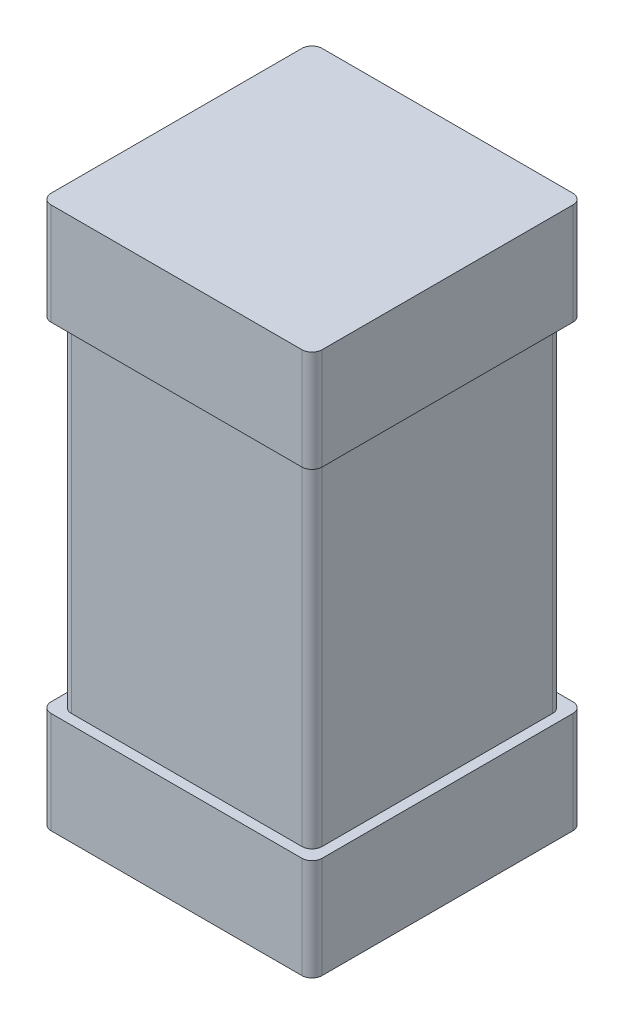
ISO-10303-21;
HEADER;
FILE_DESCRIPTION(('STEP AP214'),'2;1');
FILE_NAME('part.step','',(''),(''),'','','');
FILE_SCHEMA(('AUTOMOTIVE_DESIGN { 1 0 10303 214 1 1 1 1 }'));
ENDSEC;
DATA;
#1=APPLICATION_CONTEXT('core data for automotive mechanical design processes');
#2=APPLICATION_PROTOCOL_DEFINITION('international standard','automotive_design',2000,#1);
#3=PRODUCT_CONTEXT('',#1,'mechanical');
#4=PRODUCT('Part','Part','',(#3));
#5=PRODUCT_RELATED_PRODUCT_CATEGORY('part','',(#4));
#6=PRODUCT_DEFINITION_FORMATION('','',#4);
#7=PRODUCT_DEFINITION_CONTEXT('part definition',#1,'design');
#8=PRODUCT_DEFINITION('design','',#6,#7);
#9=PRODUCT_DEFINITION_SHAPE('','',#8);
#10=(LENGTH_UNIT() NAMED_UNIT(*) SI_UNIT(.MILLI.,.METRE.));
#11=(NAMED_UNIT(*) PLANE_ANGLE_UNIT() SI_UNIT($,.RADIAN.));
#12=(NAMED_UNIT(*) SI_UNIT($,.STERADIAN.) SOLID_ANGLE_UNIT());
#13=UNCERTAINTY_MEASURE_WITH_UNIT(LENGTH_MEASURE(1.E-05),#10,'distance_accuracy_value','');
#14=(GEOMETRIC_REPRESENTATION_CONTEXT(3) GLOBAL_UNCERTAINTY_ASSIGNED_CONTEXT((#13)) GLOBAL_UNIT_ASSIGNED_CONTEXT((#10,
#11,#12)) REPRESENTATION_CONTEXT('',''));
#15=CARTESIAN_POINT('',(0.,0.,0.));
#16=DIRECTION('',(0.,0.,1.));
#17=DIRECTION('',(1.,0.,0.));
#18=AXIS2_PLACEMENT_3D('',#15,#16,#17);
#19=CARTESIAN_POINT('',(182.392744279938,99.9820432923502,112.211582908599));
#20=DIRECTION('',(0.,-1.,0.));
#21=DIRECTION('',(0.,0.,-1.));
#22=AXIS2_PLACEMENT_3D('',#19,#20,#21);
#23=PLANE('',#22);
#24=DIRECTION('',(0.,0.,1.));
#25=VECTOR('',#24,1.);
#26=CARTESIAN_POINT('',(182.392744279938,99.9820432923502,112.211582908599));
#27=LINE('',#26,#25);
#28=CARTESIAN_POINT('',(182.392744279938,99.9820432923502,112.241582908599));
#29=VERTEX_POINT('',#28);
#30=CARTESIAN_POINT('',(182.392744279938,99.9820432923502,112.981582908599));
#31=VERTEX_POINT('',#30);
#32=EDGE_CURVE('E48',#29,#31,#27,.T.);
#33=ORIENTED_EDGE('',*,*,#32,.F.);
#34=CARTESIAN_POINT('',(182.422744279938,99.9820432923502,112.241582908599));
#35=DIRECTION('',(0.,-1.,0.));
#36=DIRECTION('',(0.,0.,1.));
#37=AXIS2_PLACEMENT_3D('',#34,#35,#36);
#38=CIRCLE('',#37,0.0300000000000023);
#39=CARTESIAN_POINT('',(182.422744279938,99.9820432923502,112.211582908599));
#40=VERTEX_POINT('',#39);
#41=EDGE_CURVE('E11',#29,#40,#38,.T.);
#42=ORIENTED_EDGE('',*,*,#41,.T.);
#43=DIRECTION('',(1.,0.,0.));
#44=VECTOR('',#43,1.);
#45=CARTESIAN_POINT('',(182.392744279938,99.9820432923502,112.211582908599));
#46=LINE('',#45,#44);
#47=CARTESIAN_POINT('',(183.162744279938,99.9820432923502,112.211582908599));
#48=VERTEX_POINT('',#47);
#49=EDGE_CURVE('E55',#40,#48,#46,.T.);
#50=ORIENTED_EDGE('',*,*,#49,.T.);
#51=CARTESIAN_POINT('',(183.162744279938,99.9820432923502,112.241582908599));
#52=DIRECTION('',(0.,1.,0.));
#53=DIRECTION('',(0.,0.,1.));
#54=AXIS2_PLACEMENT_3D('',#51,#52,#53);
#55=CIRCLE('',#54,0.0300000000000023);
#56=CARTESIAN_POINT('',(183.192744279938,99.9820432923502,112.241582908599));
#57=VERTEX_POINT('',#56);
#58=EDGE_CURVE('E289',#57,#48,#55,.T.);
#59=ORIENTED_EDGE('',*,*,#58,.F.);
#60=DIRECTION('',(0.,0.,1.));
#61=VECTOR('',#60,1.);
#62=CARTESIAN_POINT('',(183.192744279938,99.9820432923502,112.211582908599));
#63=LINE('',#62,#61);
#64=CARTESIAN_POINT('',(183.192744279938,99.9820432923502,112.981582908599));
#65=VERTEX_POINT('',#64);
#66=EDGE_CURVE('E201',#57,#65,#63,.T.);
#67=ORIENTED_EDGE('',*,*,#66,.T.);
#68=CARTESIAN_POINT('',(183.162744279938,99.9820432923502,112.981582908599));
#69=DIRECTION('',(0.,-1.,0.));
#70=DIRECTION('',(0.,0.,1.));
#71=AXIS2_PLACEMENT_3D('',#68,#69,#70);
#72=CIRCLE('',#71,0.0300000000000023);
#73=CARTESIAN_POINT('',(183.162744279938,99.9820432923502,113.011582908599));
#74=VERTEX_POINT('',#73);
#75=EDGE_CURVE('E394',#65,#74,#72,.T.);
#76=ORIENTED_EDGE('',*,*,#75,.T.);
#77=DIRECTION('',(1.,0.,0.));
#78=VECTOR('',#77,1.);
#79=CARTESIAN_POINT('',(182.392744279938,99.9820432923502,113.011582908599));
#80=LINE('',#79,#78);
#81=CARTESIAN_POINT('',(182.422744279938,99.9820432923502,113.011582908599));
#82=VERTEX_POINT('',#81);
#83=EDGE_CURVE('E355',#82,#74,#80,.T.);
#84=ORIENTED_EDGE('',*,*,#83,.F.);
#85=CARTESIAN_POINT('',(182.422744279938,99.9820432923502,112.981582908599));
#86=DIRECTION('',(0.,1.,0.));
#87=DIRECTION('',(0.,0.,1.));
#88=AXIS2_PLACEMENT_3D('',#85,#86,#87);
#89=CIRCLE('',#88,0.0300000000000023);
#90=EDGE_CURVE('E203',#31,#82,#89,.T.);
#91=ORIENTED_EDGE('',*,*,#90,.F.);
#92=EDGE_LOOP('',(#33,#42,#50,#59,#67,#76,#84,#91));
#93=FACE_BOUND('',#92,.T.);
#94=ADVANCED_FACE('F44',(#93),#23,.T.);
#95=CARTESIAN_POINT('',(183.192744279938,100.28204329235,112.211582908599));
#96=DIRECTION('',(1.,0.,0.));
#97=DIRECTION('',(0.,0.,1.));
#98=AXIS2_PLACEMENT_3D('',#95,#96,#97);
#99=PLANE('',#98);
#100=ORIENTED_EDGE('',*,*,#66,.F.);
#101=DIRECTION('',(0.,-1.,0.));
#102=VECTOR('',#101,1.);
#103=CARTESIAN_POINT('',(183.192744279938,100.28204329235,112.241582908599));
#104=LINE('',#103,#102);
#105=CARTESIAN_POINT('',(183.192744279938,100.28204329235,112.241582908599));
#106=VERTEX_POINT('',#105);
#107=EDGE_CURVE('E285',#106,#57,#104,.T.);
#108=ORIENTED_EDGE('',*,*,#107,.F.);
#109=DIRECTION('',(0.,0.,1.));
#110=VECTOR('',#109,1.);
#111=CARTESIAN_POINT('',(183.192744279938,100.28204329235,112.211582908599));
#112=LINE('',#111,#110);
#113=CARTESIAN_POINT('',(183.192744279938,100.28204329235,112.981582908599));
#114=VERTEX_POINT('',#113);
#115=EDGE_CURVE('E398',#106,#114,#112,.T.);
#116=ORIENTED_EDGE('',*,*,#115,.T.);
#117=DIRECTION('',(0.,-1.,0.));
#118=VECTOR('',#117,1.);
#119=CARTESIAN_POINT('',(183.192744279938,100.28204329235,112.981582908599));
#120=LINE('',#119,#118);
#121=EDGE_CURVE('E255',#114,#65,#120,.T.);
#122=ORIENTED_EDGE('',*,*,#121,.T.);
#123=EDGE_LOOP('',(#100,#108,#116,#122));
#124=FACE_BOUND('',#123,.T.);
#125=ADVANCED_FACE('F501',(#124),#99,.T.);
#126=CARTESIAN_POINT('',(183.162744279938,100.28204329235,112.981582908599));
#127=DIRECTION('',(0.,-1.,0.));
#128=DIRECTION('',(1.,0.,0.));
#129=AXIS2_PLACEMENT_3D('',#126,#127,#128);
#130=CYLINDRICAL_SURFACE('',#129,0.0300000000000023);
#131=CARTESIAN_POINT('',(183.162744279938,100.28204329235,112.981582908599));
#132=DIRECTION('',(0.,-1.,0.));
#133=DIRECTION('',(0.,0.,1.));
#134=AXIS2_PLACEMENT_3D('',#131,#132,#133);
#135=CIRCLE('',#134,0.0300000000000023);
#136=CARTESIAN_POINT('',(183.162744279938,100.28204329235,113.011582908599));
#137=VERTEX_POINT('',#136);
#138=EDGE_CURVE('E251',#114,#137,#135,.T.);
#139=ORIENTED_EDGE('',*,*,#138,.T.);
#140=DIRECTION('',(0.,-1.,0.));
#141=VECTOR('',#140,1.);
#142=CARTESIAN_POINT('',(183.162744279938,100.28204329235,113.011582908599));
#143=LINE('',#142,#141);
#144=EDGE_CURVE('E256',#137,#74,#143,.T.);
#145=ORIENTED_EDGE('',*,*,#144,.T.);
#146=ORIENTED_EDGE('',*,*,#75,.F.);
#147=ORIENTED_EDGE('',*,*,#121,.F.);
#148=EDGE_LOOP('',(#139,#145,#146,#147));
#149=FACE_BOUND('',#148,.T.);
#150=ADVANCED_FACE('F506',(#149),#130,.T.);
#151=CARTESIAN_POINT('',(183.162744279938,100.28204329235,112.241582908599));
#152=DIRECTION('',(0.,-1.,0.));
#153=DIRECTION('',(1.,0.,0.));
#154=AXIS2_PLACEMENT_3D('',#151,#152,#153);
#155=CYLINDRICAL_SURFACE('',#154,0.0300000000000023);
#156=ORIENTED_EDGE('',*,*,#107,.T.);
#157=ORIENTED_EDGE('',*,*,#58,.T.);
#158=DIRECTION('',(0.,-1.,0.));
#159=VECTOR('',#158,1.);
#160=CARTESIAN_POINT('',(183.162744279938,100.28204329235,112.211582908599));
#161=LINE('',#160,#159);
#162=CARTESIAN_POINT('',(183.162744279938,100.28204329235,112.211582908599));
#163=VERTEX_POINT('',#162);
#164=EDGE_CURVE('E224',#163,#48,#161,.T.);
#165=ORIENTED_EDGE('',*,*,#164,.F.);
#166=CARTESIAN_POINT('',(183.162744279938,100.28204329235,112.241582908599));
#167=DIRECTION('',(0.,1.,0.));
#168=DIRECTION('',(0.,0.,1.));
#169=AXIS2_PLACEMENT_3D('',#166,#167,#168);
#170=CIRCLE('',#169,0.0300000000000023);
#171=EDGE_CURVE('E312',#106,#163,#170,.T.);
#172=ORIENTED_EDGE('',*,*,#171,.F.);
#173=EDGE_LOOP('',(#156,#157,#165,#172));
#174=FACE_BOUND('',#173,.T.);
#175=ADVANCED_FACE('F703',(#174),#155,.T.);
#176=CARTESIAN_POINT('',(182.392744279938,100.28204329235,113.011582908599));
#177=DIRECTION('',(0.,0.,1.));
#178=DIRECTION('',(1.,0.,0.));
#179=AXIS2_PLACEMENT_3D('',#176,#177,#178);
#180=PLANE('',#179);
#181=DIRECTION('',(1.,0.,0.));
#182=VECTOR('',#181,1.);
#183=CARTESIAN_POINT('',(182.392744279938,100.28204329235,113.011582908599));
#184=LINE('',#183,#182);
#185=CARTESIAN_POINT('',(182.422744279938,100.28204329235,113.011582908599));
#186=VERTEX_POINT('',#185);
#187=EDGE_CURVE('E284',#186,#137,#184,.T.);
#188=ORIENTED_EDGE('',*,*,#187,.F.);
#189=DIRECTION('',(0.,-1.,0.));
#190=VECTOR('',#189,1.);
#191=CARTESIAN_POINT('',(182.422744279938,100.28204329235,113.011582908599));
#192=LINE('',#191,#190);
#193=EDGE_CURVE('E348',#186,#82,#192,.T.);
#194=ORIENTED_EDGE('',*,*,#193,.T.);
#195=ORIENTED_EDGE('',*,*,#83,.T.);
#196=ORIENTED_EDGE('',*,*,#144,.F.);
#197=EDGE_LOOP('',(#188,#194,#195,#196));
#198=FACE_BOUND('',#197,.T.);
#199=ADVANCED_FACE('F692',(#198),#180,.T.);
#200=CARTESIAN_POINT('',(182.392744279938,100.28204329235,112.211582908599));
#201=DIRECTION('',(0.,0.,1.));
#202=DIRECTION('',(1.,0.,0.));
#203=AXIS2_PLACEMENT_3D('',#200,#201,#202);
#204=PLANE('',#203);
#205=ORIENTED_EDGE('',*,*,#164,.T.);
#206=ORIENTED_EDGE('',*,*,#49,.F.);
#207=DIRECTION('',(0.,-1.,0.));
#208=VECTOR('',#207,1.);
#209=CARTESIAN_POINT('',(182.422744279938,100.28204329235,112.211582908599));
#210=LINE('',#209,#208);
#211=CARTESIAN_POINT('',(182.422744279938,100.28204329235,112.211582908599));
#212=VERTEX_POINT('',#211);
#213=EDGE_CURVE('E298',#212,#40,#210,.T.);
#214=ORIENTED_EDGE('',*,*,#213,.F.);
#215=DIRECTION('',(1.,0.,0.));
#216=VECTOR('',#215,1.);
#217=CARTESIAN_POINT('',(182.392744279938,100.28204329235,112.211582908599));
#218=LINE('',#217,#216);
#219=EDGE_CURVE('E220',#212,#163,#218,.T.);
#220=ORIENTED_EDGE('',*,*,#219,.T.);
#221=EDGE_LOOP('',(#205,#206,#214,#220));
#222=FACE_BOUND('',#221,.T.);
#223=ADVANCED_FACE('F680',(#222),#204,.F.);
#224=CARTESIAN_POINT('',(182.422744279938,100.28204329235,112.981582908599));
#225=DIRECTION('',(0.,-1.,0.));
#226=DIRECTION('',(-1.,0.,0.));
#227=AXIS2_PLACEMENT_3D('',#224,#225,#226);
#228=CYLINDRICAL_SURFACE('',#227,0.0300000000000023);
#229=DIRECTION('',(0.,-1.,0.));
#230=VECTOR('',#229,1.);
#231=CARTESIAN_POINT('',(182.392744279938,100.28204329235,112.981582908599));
#232=LINE('',#231,#230);
#233=CARTESIAN_POINT('',(182.392744279938,100.28204329235,112.981582908599));
#234=VERTEX_POINT('',#233);
#235=EDGE_CURVE('E206',#234,#31,#232,.T.);
#236=ORIENTED_EDGE('',*,*,#235,.T.);
#237=ORIENTED_EDGE('',*,*,#90,.T.);
#238=ORIENTED_EDGE('',*,*,#193,.F.);
#239=CARTESIAN_POINT('',(182.422744279938,100.28204329235,112.981582908599));
#240=DIRECTION('',(0.,1.,0.));
#241=DIRECTION('',(0.,0.,1.));
#242=AXIS2_PLACEMENT_3D('',#239,#240,#241);
#243=CIRCLE('',#242,0.0300000000000023);
#244=EDGE_CURVE('E280',#234,#186,#243,.T.);
#245=ORIENTED_EDGE('',*,*,#244,.F.);
#246=EDGE_LOOP('',(#236,#237,#238,#245));
#247=FACE_BOUND('',#246,.T.);
#248=ADVANCED_FACE('F525',(#247),#228,.T.);
#249=CARTESIAN_POINT('',(182.422744279938,100.28204329235,112.241582908599));
#250=DIRECTION('',(0.,-1.,0.));
#251=DIRECTION('',(-1.,0.,0.));
#252=AXIS2_PLACEMENT_3D('',#249,#250,#251);
#253=CYLINDRICAL_SURFACE('',#252,0.0300000000000023);
#254=CARTESIAN_POINT('',(182.422744279938,100.28204329235,112.241582908599));
#255=DIRECTION('',(0.,-1.,0.));
#256=DIRECTION('',(0.,0.,1.));
#257=AXIS2_PLACEMENT_3D('',#254,#255,#256);
#258=CIRCLE('',#257,0.0300000000000023);
#259=CARTESIAN_POINT('',(182.392744279938,100.28204329235,112.241582908599));
#260=VERTEX_POINT('',#259);
#261=EDGE_CURVE('E207',#260,#212,#258,.T.);
#262=ORIENTED_EDGE('',*,*,#261,.T.);
#263=ORIENTED_EDGE('',*,*,#213,.T.);
#264=ORIENTED_EDGE('',*,*,#41,.F.);
#265=DIRECTION('',(0.,-1.,0.));
#266=VECTOR('',#265,1.);
#267=CARTESIAN_POINT('',(182.392744279938,100.28204329235,112.241582908599));
#268=LINE('',#267,#266);
#269=EDGE_CURVE('E294',#260,#29,#268,.T.);
#270=ORIENTED_EDGE('',*,*,#269,.F.);
#271=EDGE_LOOP('',(#262,#263,#264,#270));
#272=FACE_BOUND('',#271,.T.);
#273=ADVANCED_FACE('F521',(#272),#253,.T.);
#274=CARTESIAN_POINT('',(182.392744279938,100.28204329235,112.211582908599));
#275=DIRECTION('',(1.,0.,0.));
#276=DIRECTION('',(0.,0.,1.));
#277=AXIS2_PLACEMENT_3D('',#274,#275,#276);
#278=PLANE('',#277);
#279=ORIENTED_EDGE('',*,*,#235,.F.);
#280=DIRECTION('',(0.,0.,1.));
#281=VECTOR('',#280,1.);
#282=CARTESIAN_POINT('',(182.392744279938,100.28204329235,112.211582908599));
#283=LINE('',#282,#281);
#284=EDGE_CURVE('E185',#260,#234,#283,.T.);
#285=ORIENTED_EDGE('',*,*,#284,.F.);
#286=ORIENTED_EDGE('',*,*,#269,.T.);
#287=ORIENTED_EDGE('',*,*,#32,.T.);
#288=EDGE_LOOP('',(#279,#285,#286,#287));
#289=FACE_BOUND('',#288,.T.);
#290=ADVANCED_FACE('F524',(#289),#278,.F.);
#291=CARTESIAN_POINT('',(182.392744279938,100.28204329235,112.211582908599));
#292=DIRECTION('',(0.,-1.,0.));
#293=DIRECTION('',(0.,0.,-1.));
#294=AXIS2_PLACEMENT_3D('',#291,#292,#293);
#295=PLANE('',#294);
#296=ORIENTED_EDGE('',*,*,#244,.T.);
#297=ORIENTED_EDGE('',*,*,#187,.T.);
#298=ORIENTED_EDGE('',*,*,#138,.F.);
#299=ORIENTED_EDGE('',*,*,#115,.F.);
#300=ORIENTED_EDGE('',*,*,#171,.T.);
#301=ORIENTED_EDGE('',*,*,#219,.F.);
#302=ORIENTED_EDGE('',*,*,#261,.F.);
#303=ORIENTED_EDGE('',*,*,#284,.T.);
#304=EDGE_LOOP('',(#296,#297,#298,#299,#300,#301,#302,#303));
#305=FACE_BOUND('',#304,.T.);
#306=DIRECTION('',(1.,0.,0.));
#307=VECTOR('',#306,1.);
#308=CARTESIAN_POINT('',(182.422744279938,100.28204329235,112.241582908599));
#309=LINE('',#308,#307);
#310=CARTESIAN_POINT('',(182.452744279938,100.28204329235,112.241582908599));
#311=VERTEX_POINT('',#310);
#312=CARTESIAN_POINT('',(183.132744279938,100.28204329235,112.241582908599));
#313=VERTEX_POINT('',#312);
#314=EDGE_CURVE('E177',#311,#313,#309,.T.);
#315=ORIENTED_EDGE('',*,*,#314,.T.);
#316=CARTESIAN_POINT('',(183.132744279938,100.28204329235,112.271582908599));
#317=DIRECTION('',(0.,1.,0.));
#318=DIRECTION('',(0.,0.,1.));
#319=AXIS2_PLACEMENT_3D('',#316,#317,#318);
#320=CIRCLE('',#319,0.0300000000000023);
#321=CARTESIAN_POINT('',(183.162744279938,100.28204329235,112.271582908599));
#322=VERTEX_POINT('',#321);
#323=EDGE_CURVE('E162',#322,#313,#320,.T.);
#324=ORIENTED_EDGE('',*,*,#323,.F.);
#325=DIRECTION('',(0.,0.,1.));
#326=VECTOR('',#325,1.);
#327=CARTESIAN_POINT('',(183.162744279938,100.28204329235,112.241582908599));
#328=LINE('',#327,#326);
#329=CARTESIAN_POINT('',(183.162744279938,100.28204329235,112.951582908599));
#330=VERTEX_POINT('',#329);
#331=EDGE_CURVE('E186',#322,#330,#328,.T.);
#332=ORIENTED_EDGE('',*,*,#331,.T.);
#333=CARTESIAN_POINT('',(183.132744279938,100.28204329235,112.951582908599));
#334=DIRECTION('',(0.,-1.,0.));
#335=DIRECTION('',(0.,0.,1.));
#336=AXIS2_PLACEMENT_3D('',#333,#334,#335);
#337=CIRCLE('',#336,0.0300000000000023);
#338=CARTESIAN_POINT('',(183.132744279938,100.28204329235,112.981582908599));
#339=VERTEX_POINT('',#338);
#340=EDGE_CURVE('E270',#330,#339,#337,.T.);
#341=ORIENTED_EDGE('',*,*,#340,.T.);
#342=DIRECTION('',(1.,0.,0.));
#343=VECTOR('',#342,1.);
#344=CARTESIAN_POINT('',(182.422744279938,100.28204329235,112.981582908599));
#345=LINE('',#344,#343);
#346=CARTESIAN_POINT('',(182.452744279938,100.28204329235,112.981582908599));
#347=VERTEX_POINT('',#346);
#348=EDGE_CURVE('E230',#347,#339,#345,.T.);
#349=ORIENTED_EDGE('',*,*,#348,.F.);
#350=CARTESIAN_POINT('',(182.452744279938,100.28204329235,112.951582908599));
#351=DIRECTION('',(0.,1.,0.));
#352=DIRECTION('',(0.,0.,1.));
#353=AXIS2_PLACEMENT_3D('',#350,#351,#352);
#354=CIRCLE('',#353,0.0300000000000023);
#355=CARTESIAN_POINT('',(182.422744279938,100.28204329235,112.951582908599));
#356=VERTEX_POINT('',#355);
#357=EDGE_CURVE('E229',#356,#347,#354,.T.);
#358=ORIENTED_EDGE('',*,*,#357,.F.);
#359=DIRECTION('',(0.,0.,1.));
#360=VECTOR('',#359,1.);
#361=CARTESIAN_POINT('',(182.422744279938,100.28204329235,112.241582908599));
#362=LINE('',#361,#360);
#363=CARTESIAN_POINT('',(182.422744279938,100.28204329235,112.271582908599));
#364=VERTEX_POINT('',#363);
#365=EDGE_CURVE('E214',#364,#356,#362,.T.);
#366=ORIENTED_EDGE('',*,*,#365,.F.);
#367=CARTESIAN_POINT('',(182.452744279938,100.28204329235,112.271582908599));
#368=DIRECTION('',(0.,-1.,0.));
#369=DIRECTION('',(0.,0.,1.));
#370=AXIS2_PLACEMENT_3D('',#367,#368,#369);
#371=CIRCLE('',#370,0.0300000000000023);
#372=EDGE_CURVE('E180',#364,#311,#371,.T.);
#373=ORIENTED_EDGE('',*,*,#372,.T.);
#374=EDGE_LOOP('',(#315,#324,#332,#341,#349,#358,#366,#373));
#375=FACE_BOUND('',#374,.T.);
#376=ADVANCED_FACE('F178',(#305,#375),#295,.F.);
#377=CARTESIAN_POINT('',(182.422744279938,101.28204329235,112.241582908599));
#378=DIRECTION('',(1.,0.,0.));
#379=DIRECTION('',(0.,0.,1.));
#380=AXIS2_PLACEMENT_3D('',#377,#378,#379);
#381=PLANE('',#380);
#382=DIRECTION('',(0.,-1.,0.));
#383=VECTOR('',#382,1.);
#384=CARTESIAN_POINT('',(182.422744279938,101.28204329235,112.951582908599));
#385=LINE('',#384,#383);
#386=CARTESIAN_POINT('',(182.422744279938,101.28204329235,112.951582908599));
#387=VERTEX_POINT('',#386);
#388=EDGE_CURVE('E219',#387,#356,#385,.T.);
#389=ORIENTED_EDGE('',*,*,#388,.F.);
#390=DIRECTION('',(0.,0.,1.));
#391=VECTOR('',#390,1.);
#392=CARTESIAN_POINT('',(182.422744279938,101.28204329235,112.241582908599));
#393=LINE('',#392,#391);
#394=CARTESIAN_POINT('',(182.422744279938,101.28204329235,112.271582908599));
#395=VERTEX_POINT('',#394);
#396=EDGE_CURVE('E417',#395,#387,#393,.T.);
#397=ORIENTED_EDGE('',*,*,#396,.F.);
#398=DIRECTION('',(0.,-1.,0.));
#399=VECTOR('',#398,1.);
#400=CARTESIAN_POINT('',(182.422744279938,101.28204329235,112.271582908599));
#401=LINE('',#400,#399);
#402=EDGE_CURVE('E218',#395,#364,#401,.T.);
#403=ORIENTED_EDGE('',*,*,#402,.T.);
#404=ORIENTED_EDGE('',*,*,#365,.T.);
#405=EDGE_LOOP('',(#389,#397,#403,#404));
#406=FACE_BOUND('',#405,.T.);
#407=ADVANCED_FACE('F546',(#406),#381,.F.);
#408=CARTESIAN_POINT('',(182.452744279938,101.28204329235,112.951582908599));
#409=DIRECTION('',(0.,-1.,0.));
#410=DIRECTION('',(-1.,0.,0.));
#411=AXIS2_PLACEMENT_3D('',#408,#409,#410);
#412=CYLINDRICAL_SURFACE('',#411,0.0300000000000023);
#413=ORIENTED_EDGE('',*,*,#388,.T.);
#414=ORIENTED_EDGE('',*,*,#357,.T.);
#415=DIRECTION('',(0.,-1.,0.));
#416=VECTOR('',#415,1.);
#417=CARTESIAN_POINT('',(182.452744279938,101.28204329235,112.981582908599));
#418=LINE('',#417,#416);
#419=CARTESIAN_POINT('',(182.452744279938,101.28204329235,112.981582908599));
#420=VERTEX_POINT('',#419);
#421=EDGE_CURVE('E225',#420,#347,#418,.T.);
#422=ORIENTED_EDGE('',*,*,#421,.F.);
#423=CARTESIAN_POINT('',(182.452744279938,101.28204329235,112.951582908599));
#424=DIRECTION('',(0.,1.,0.));
#425=DIRECTION('',(0.,0.,1.));
#426=AXIS2_PLACEMENT_3D('',#423,#424,#425);
#427=CIRCLE('',#426,0.0300000000000023);
#428=EDGE_CURVE('E421',#387,#420,#427,.T.);
#429=ORIENTED_EDGE('',*,*,#428,.F.);
#430=EDGE_LOOP('',(#413,#414,#422,#429));
#431=FACE_BOUND('',#430,.T.);
#432=ADVANCED_FACE('F514',(#431),#412,.T.);
#433=CARTESIAN_POINT('',(182.422744279938,101.28204329235,112.981582908599));
#434=DIRECTION('',(0.,0.,1.));
#435=DIRECTION('',(1.,0.,0.));
#436=AXIS2_PLACEMENT_3D('',#433,#434,#435);
#437=PLANE('',#436);
#438=DIRECTION('',(1.,0.,0.));
#439=VECTOR('',#438,1.);
#440=CARTESIAN_POINT('',(182.422744279938,101.28204329235,112.981582908599));
#441=LINE('',#440,#439);
#442=CARTESIAN_POINT('',(183.132744279938,101.28204329235,112.981582908599));
#443=VERTEX_POINT('',#442);
#444=EDGE_CURVE('E365',#420,#443,#441,.T.);
#445=ORIENTED_EDGE('',*,*,#444,.F.);
#446=ORIENTED_EDGE('',*,*,#421,.T.);
#447=ORIENTED_EDGE('',*,*,#348,.T.);
#448=DIRECTION('',(0.,-1.,0.));
#449=VECTOR('',#448,1.);
#450=CARTESIAN_POINT('',(183.132744279938,101.28204329235,112.981582908599));
#451=LINE('',#450,#449);
#452=EDGE_CURVE('E235',#443,#339,#451,.T.);
#453=ORIENTED_EDGE('',*,*,#452,.F.);
#454=EDGE_LOOP('',(#445,#446,#447,#453));
#455=FACE_BOUND('',#454,.T.);
#456=ADVANCED_FACE('F476',(#455),#437,.T.);
#457=CARTESIAN_POINT('',(183.132744279938,101.28204329235,112.951582908599));
#458=DIRECTION('',(0.,-1.,0.));
#459=DIRECTION('',(1.,0.,0.));
#460=AXIS2_PLACEMENT_3D('',#457,#458,#459);
#461=CYLINDRICAL_SURFACE('',#460,0.0300000000000023);
#462=CARTESIAN_POINT('',(183.132744279938,101.28204329235,112.951582908599));
#463=DIRECTION('',(0.,-1.,0.));
#464=DIRECTION('',(0.,0.,1.));
#465=AXIS2_PLACEMENT_3D('',#462,#463,#464);
#466=CIRCLE('',#465,0.0300000000000023);
#467=CARTESIAN_POINT('',(183.162744279938,101.28204329235,112.951582908599));
#468=VERTEX_POINT('',#467);
#469=EDGE_CURVE('E231',#468,#443,#466,.T.);
#470=ORIENTED_EDGE('',*,*,#469,.T.);
#471=ORIENTED_EDGE('',*,*,#452,.T.);
#472=ORIENTED_EDGE('',*,*,#340,.F.);
#473=DIRECTION('',(0.,-1.,0.));
#474=VECTOR('',#473,1.);
#475=CARTESIAN_POINT('',(183.162744279938,101.28204329235,112.951582908599));
#476=LINE('',#475,#474);
#477=EDGE_CURVE('E250',#468,#330,#476,.T.);
#478=ORIENTED_EDGE('',*,*,#477,.F.);
#479=EDGE_LOOP('',(#470,#471,#472,#478));
#480=FACE_BOUND('',#479,.T.);
#481=ADVANCED_FACE('F480',(#480),#461,.T.);
#482=CARTESIAN_POINT('',(183.162744279938,101.28204329235,112.241582908599));
#483=DIRECTION('',(1.,0.,0.));
#484=DIRECTION('',(0.,0.,1.));
#485=AXIS2_PLACEMENT_3D('',#482,#483,#484);
#486=PLANE('',#485);
#487=ORIENTED_EDGE('',*,*,#331,.F.);
#488=DIRECTION('',(0.,-1.,0.));
#489=VECTOR('',#488,1.);
#490=CARTESIAN_POINT('',(183.162744279938,101.28204329235,112.271582908599));
#491=LINE('',#490,#489);
#492=CARTESIAN_POINT('',(183.162744279938,101.28204329235,112.271582908599));
#493=VERTEX_POINT('',#492);
#494=EDGE_CURVE('E169',#493,#322,#491,.T.);
#495=ORIENTED_EDGE('',*,*,#494,.F.);
#496=DIRECTION('',(0.,0.,1.));
#497=VECTOR('',#496,1.);
#498=CARTESIAN_POINT('',(183.162744279938,101.28204329235,112.241582908599));
#499=LINE('',#498,#497);
#500=EDGE_CURVE('E276',#493,#468,#499,.T.);
#501=ORIENTED_EDGE('',*,*,#500,.T.);
#502=ORIENTED_EDGE('',*,*,#477,.T.);
#503=EDGE_LOOP('',(#487,#495,#501,#502));
#504=FACE_BOUND('',#503,.T.);
#505=ADVANCED_FACE('F489',(#504),#486,.T.);
#506=CARTESIAN_POINT('',(183.132744279938,101.28204329235,112.271582908599));
#507=DIRECTION('',(0.,-1.,0.));
#508=DIRECTION('',(1.,0.,0.));
#509=AXIS2_PLACEMENT_3D('',#506,#507,#508);
#510=CYLINDRICAL_SURFACE('',#509,0.0300000000000023);
#511=ORIENTED_EDGE('',*,*,#494,.T.);
#512=ORIENTED_EDGE('',*,*,#323,.T.);
#513=DIRECTION('',(0.,-1.,0.));
#514=VECTOR('',#513,1.);
#515=CARTESIAN_POINT('',(183.132744279938,101.28204329235,112.241582908599));
#516=LINE('',#515,#514);
#517=CARTESIAN_POINT('',(183.132744279938,101.28204329235,112.241582908599));
#518=VERTEX_POINT('',#517);
#519=EDGE_CURVE('E167',#518,#313,#516,.T.);
#520=ORIENTED_EDGE('',*,*,#519,.F.);
#521=CARTESIAN_POINT('',(183.132744279938,101.28204329235,112.271582908599));
#522=DIRECTION('',(0.,1.,0.));
#523=DIRECTION('',(0.,0.,1.));
#524=AXIS2_PLACEMENT_3D('',#521,#522,#523);
#525=CIRCLE('',#524,0.0300000000000023);
#526=EDGE_CURVE('E362',#493,#518,#525,.T.);
#527=ORIENTED_EDGE('',*,*,#526,.F.);
#528=EDGE_LOOP('',(#511,#512,#520,#527));
#529=FACE_BOUND('',#528,.T.);
#530=ADVANCED_FACE('F164',(#529),#510,.T.);
#531=CARTESIAN_POINT('',(182.422744279938,101.28204329235,112.241582908599));
#532=DIRECTION('',(0.,0.,1.));
#533=DIRECTION('',(1.,0.,0.));
#534=AXIS2_PLACEMENT_3D('',#531,#532,#533);
#535=PLANE('',#534);
#536=ORIENTED_EDGE('',*,*,#519,.T.);
#537=ORIENTED_EDGE('',*,*,#314,.F.);
#538=DIRECTION('',(0.,-1.,0.));
#539=VECTOR('',#538,1.);
#540=CARTESIAN_POINT('',(182.452744279938,101.28204329235,112.241582908599));
#541=LINE('',#540,#539);
#542=CARTESIAN_POINT('',(182.452744279938,101.28204329235,112.241582908599));
#543=VERTEX_POINT('',#542);
#544=EDGE_CURVE('E319',#543,#311,#541,.T.);
#545=ORIENTED_EDGE('',*,*,#544,.F.);
#546=DIRECTION('',(1.,0.,0.));
#547=VECTOR('',#546,1.);
#548=CARTESIAN_POINT('',(182.422744279938,101.28204329235,112.241582908599));
#549=LINE('',#548,#547);
#550=EDGE_CURVE('E190',#543,#518,#549,.T.);
#551=ORIENTED_EDGE('',*,*,#550,.T.);
#552=EDGE_LOOP('',(#536,#537,#545,#551));
#553=FACE_BOUND('',#552,.T.);
#554=ADVANCED_FACE('F188',(#553),#535,.F.);
#555=CARTESIAN_POINT('',(182.452744279938,101.28204329235,112.271582908599));
#556=DIRECTION('',(0.,-1.,0.));
#557=DIRECTION('',(-1.,0.,0.));
#558=AXIS2_PLACEMENT_3D('',#555,#556,#557);
#559=CYLINDRICAL_SURFACE('',#558,0.0300000000000023);
#560=CARTESIAN_POINT('',(182.452744279938,101.28204329235,112.271582908599));
#561=DIRECTION('',(0.,-1.,0.));
#562=DIRECTION('',(0.,0.,1.));
#563=AXIS2_PLACEMENT_3D('',#560,#561,#562);
#564=CIRCLE('',#563,0.0300000000000023);
#565=EDGE_CURVE('E197',#395,#543,#564,.T.);
#566=ORIENTED_EDGE('',*,*,#565,.T.);
#567=ORIENTED_EDGE('',*,*,#544,.T.);
#568=ORIENTED_EDGE('',*,*,#372,.F.);
#569=ORIENTED_EDGE('',*,*,#402,.F.);
#570=EDGE_LOOP('',(#566,#567,#568,#569));
#571=FACE_BOUND('',#570,.T.);
#572=ADVANCED_FACE('F515',(#571),#559,.T.);
#573=CARTESIAN_POINT('',(182.392744279938,101.28204329235,112.211582908599));
#574=DIRECTION('',(0.,-1.,0.));
#575=DIRECTION('',(0.,0.,-1.));
#576=AXIS2_PLACEMENT_3D('',#573,#574,#575);
#577=PLANE('',#576);
#578=DIRECTION('',(0.,0.,1.));
#579=VECTOR('',#578,1.);
#580=CARTESIAN_POINT('',(182.392744279938,101.28204329235,112.211582908599));
#581=LINE('',#580,#579);
#582=CARTESIAN_POINT('',(182.392744279938,101.28204329235,112.241582908599));
#583=VERTEX_POINT('',#582);
#584=CARTESIAN_POINT('',(182.392744279938,101.28204329235,112.981582908599));
#585=VERTEX_POINT('',#584);
#586=EDGE_CURVE('E374',#583,#585,#581,.T.);
#587=ORIENTED_EDGE('',*,*,#586,.F.);
#588=CARTESIAN_POINT('',(182.422744279938,101.28204329235,112.241582908599));
#589=DIRECTION('',(0.,-1.,0.));
#590=DIRECTION('',(0.,0.,1.));
#591=AXIS2_PLACEMENT_3D('',#588,#589,#590);
#592=CIRCLE('',#591,0.0300000000000023);
#593=CARTESIAN_POINT('',(182.422744279938,101.28204329235,112.211582908599));
#594=VERTEX_POINT('',#593);
#595=EDGE_CURVE('E240',#583,#594,#592,.T.);
#596=ORIENTED_EDGE('',*,*,#595,.T.);
#597=DIRECTION('',(1.,0.,0.));
#598=VECTOR('',#597,1.);
#599=CARTESIAN_POINT('',(182.392744279938,101.28204329235,112.211582908599));
#600=LINE('',#599,#598);
#601=CARTESIAN_POINT('',(183.162744279938,101.28204329235,112.211582908599));
#602=VERTEX_POINT('',#601);
#603=EDGE_CURVE('E236',#594,#602,#600,.T.);
#604=ORIENTED_EDGE('',*,*,#603,.T.);
#605=CARTESIAN_POINT('',(183.162744279938,101.28204329235,112.241582908599));
#606=DIRECTION('',(0.,1.,0.));
#607=DIRECTION('',(0.,0.,1.));
#608=AXIS2_PLACEMENT_3D('',#605,#606,#607);
#609=CIRCLE('',#608,0.0300000000000023);
#610=CARTESIAN_POINT('',(183.192744279938,101.28204329235,112.241582908599));
#611=VERTEX_POINT('',#610);
#612=EDGE_CURVE('E247',#611,#602,#609,.T.);
#613=ORIENTED_EDGE('',*,*,#612,.F.);
#614=DIRECTION('',(0.,0.,1.));
#615=VECTOR('',#614,1.);
#616=CARTESIAN_POINT('',(183.192744279938,101.28204329235,112.211582908599));
#617=LINE('',#616,#615);
#618=CARTESIAN_POINT('',(183.192744279938,101.28204329235,112.981582908599));
#619=VERTEX_POINT('',#618);
#620=EDGE_CURVE('E241',#611,#619,#617,.T.);
#621=ORIENTED_EDGE('',*,*,#620,.T.);
#622=CARTESIAN_POINT('',(183.162744279938,101.28204329235,112.981582908599));
#623=DIRECTION('',(0.,-1.,0.));
#624=DIRECTION('',(0.,0.,1.));
#625=AXIS2_PLACEMENT_3D('',#622,#623,#624);
#626=CIRCLE('',#625,0.0300000000000023);
#627=CARTESIAN_POINT('',(183.162744279938,101.28204329235,113.011582908599));
#628=VERTEX_POINT('',#627);
#629=EDGE_CURVE('E326',#619,#628,#626,.T.);
#630=ORIENTED_EDGE('',*,*,#629,.T.);
#631=DIRECTION('',(1.,0.,0.));
#632=VECTOR('',#631,1.);
#633=CARTESIAN_POINT('',(182.392744279938,101.28204329235,113.011582908599));
#634=LINE('',#633,#632);
#635=CARTESIAN_POINT('',(182.422744279938,101.28204329235,113.011582908599));
#636=VERTEX_POINT('',#635);
#637=EDGE_CURVE('E380',#636,#628,#634,.T.);
#638=ORIENTED_EDGE('',*,*,#637,.F.);
#639=CARTESIAN_POINT('',(182.422744279938,101.28204329235,112.981582908599));
#640=DIRECTION('',(0.,1.,0.));
#641=DIRECTION('',(0.,0.,1.));
#642=AXIS2_PLACEMENT_3D('',#639,#640,#641);
#643=CIRCLE('',#642,0.0300000000000023);
#644=EDGE_CURVE('E213',#585,#636,#643,.T.);
#645=ORIENTED_EDGE('',*,*,#644,.F.);
#646=EDGE_LOOP('',(#587,#596,#604,#613,#621,#630,#638,#645));
#647=FACE_BOUND('',#646,.T.);
#648=ORIENTED_EDGE('',*,*,#565,.F.);
#649=ORIENTED_EDGE('',*,*,#396,.T.);
#650=ORIENTED_EDGE('',*,*,#428,.T.);
#651=ORIENTED_EDGE('',*,*,#444,.T.);
#652=ORIENTED_EDGE('',*,*,#469,.F.);
#653=ORIENTED_EDGE('',*,*,#500,.F.);
#654=ORIENTED_EDGE('',*,*,#526,.T.);
#655=ORIENTED_EDGE('',*,*,#550,.F.);
#656=EDGE_LOOP('',(#648,#649,#650,#651,#652,#653,#654,#655));
#657=FACE_BOUND('',#656,.T.);
#658=ADVANCED_FACE('F487',(#647,#657),#577,.T.);
#659=CARTESIAN_POINT('',(183.192744279938,101.58204329235,112.211582908599));
#660=DIRECTION('',(1.,0.,0.));
#661=DIRECTION('',(0.,0.,1.));
#662=AXIS2_PLACEMENT_3D('',#659,#660,#661);
#663=PLANE('',#662);
#664=ORIENTED_EDGE('',*,*,#620,.F.);
#665=DIRECTION('',(0.,-1.,0.));
#666=VECTOR('',#665,1.);
#667=CARTESIAN_POINT('',(183.192744279938,101.58204329235,112.241582908599));
#668=LINE('',#667,#666);
#669=CARTESIAN_POINT('',(183.192744279938,101.58204329235,112.241582908599));
#670=VERTEX_POINT('',#669);
#671=EDGE_CURVE('E242',#670,#611,#668,.T.);
#672=ORIENTED_EDGE('',*,*,#671,.F.);
#673=DIRECTION('',(0.,0.,1.));
#674=VECTOR('',#673,1.);
#675=CARTESIAN_POINT('',(183.192744279938,101.58204329235,112.211582908599));
#676=LINE('',#675,#674);
#677=CARTESIAN_POINT('',(183.192744279938,101.58204329235,112.981582908599));
#678=VERTEX_POINT('',#677);
#679=EDGE_CURVE('E293',#670,#678,#676,.T.);
#680=ORIENTED_EDGE('',*,*,#679,.T.);
#681=DIRECTION('',(0.,-1.,0.));
#682=VECTOR('',#681,1.);
#683=CARTESIAN_POINT('',(183.192744279938,101.58204329235,112.981582908599));
#684=LINE('',#683,#682);
#685=EDGE_CURVE('E275',#678,#619,#684,.T.);
#686=ORIENTED_EDGE('',*,*,#685,.T.);
#687=EDGE_LOOP('',(#664,#672,#680,#686));
#688=FACE_BOUND('',#687,.T.);
#689=ADVANCED_FACE('F527',(#688),#663,.T.);
#690=CARTESIAN_POINT('',(183.162744279938,101.58204329235,112.981582908599));
#691=DIRECTION('',(0.,-1.,0.));
#692=DIRECTION('',(1.,0.,0.));
#693=AXIS2_PLACEMENT_3D('',#690,#691,#692);
#694=CYLINDRICAL_SURFACE('',#693,0.0300000000000023);
#695=CARTESIAN_POINT('',(183.162744279938,101.58204329235,112.981582908599));
#696=DIRECTION('',(0.,-1.,0.));
#697=DIRECTION('',(0.,0.,1.));
#698=AXIS2_PLACEMENT_3D('',#695,#696,#697);
#699=CIRCLE('',#698,0.0300000000000023);
#700=CARTESIAN_POINT('',(183.162744279938,101.58204329235,113.011582908599));
#701=VERTEX_POINT('',#700);
#702=EDGE_CURVE('E271',#678,#701,#699,.T.);
#703=ORIENTED_EDGE('',*,*,#702,.T.);
#704=DIRECTION('',(0.,-1.,0.));
#705=VECTOR('',#704,1.);
#706=CARTESIAN_POINT('',(183.162744279938,101.58204329235,113.011582908599));
#707=LINE('',#706,#705);
#708=EDGE_CURVE('E246',#701,#628,#707,.T.);
#709=ORIENTED_EDGE('',*,*,#708,.T.);
#710=ORIENTED_EDGE('',*,*,#629,.F.);
#711=ORIENTED_EDGE('',*,*,#685,.F.);
#712=EDGE_LOOP('',(#703,#709,#710,#711));
#713=FACE_BOUND('',#712,.T.);
#714=ADVANCED_FACE('F520',(#713),#694,.T.);
#715=CARTESIAN_POINT('',(183.162744279938,101.58204329235,112.241582908599));
#716=DIRECTION('',(0.,-1.,0.));
#717=DIRECTION('',(1.,0.,0.));
#718=AXIS2_PLACEMENT_3D('',#715,#716,#717);
#719=CYLINDRICAL_SURFACE('',#718,0.0300000000000023);
#720=ORIENTED_EDGE('',*,*,#671,.T.);
#721=ORIENTED_EDGE('',*,*,#612,.T.);
#722=DIRECTION('',(0.,-1.,0.));
#723=VECTOR('',#722,1.);
#724=CARTESIAN_POINT('',(183.162744279938,101.58204329235,112.211582908599));
#725=LINE('',#724,#723);
#726=CARTESIAN_POINT('',(183.162744279938,101.58204329235,112.211582908599));
#727=VERTEX_POINT('',#726);
#728=EDGE_CURVE('E330',#727,#602,#725,.T.);
#729=ORIENTED_EDGE('',*,*,#728,.F.);
#730=CARTESIAN_POINT('',(183.162744279938,101.58204329235,112.241582908599));
#731=DIRECTION('',(0.,1.,0.));
#732=DIRECTION('',(0.,0.,1.));
#733=AXIS2_PLACEMENT_3D('',#730,#731,#732);
#734=CIRCLE('',#733,0.0300000000000023);
#735=EDGE_CURVE('E370',#670,#727,#734,.T.);
#736=ORIENTED_EDGE('',*,*,#735,.F.);
#737=EDGE_LOOP('',(#720,#721,#729,#736));
#738=FACE_BOUND('',#737,.T.);
#739=ADVANCED_FACE('F442',(#738),#719,.T.);
#740=CARTESIAN_POINT('',(182.392744279938,101.58204329235,113.011582908599));
#741=DIRECTION('',(0.,0.,1.));
#742=DIRECTION('',(1.,0.,0.));
#743=AXIS2_PLACEMENT_3D('',#740,#741,#742);
#744=PLANE('',#743);
#745=DIRECTION('',(1.,0.,0.));
#746=VECTOR('',#745,1.);
#747=CARTESIAN_POINT('',(182.392744279938,101.58204329235,113.011582908599));
#748=LINE('',#747,#746);
#749=CARTESIAN_POINT('',(182.422744279938,101.58204329235,113.011582908599));
#750=VERTEX_POINT('',#749);
#751=EDGE_CURVE('E390',#750,#701,#748,.T.);
#752=ORIENTED_EDGE('',*,*,#751,.F.);
#753=DIRECTION('',(0.,-1.,0.));
#754=VECTOR('',#753,1.);
#755=CARTESIAN_POINT('',(182.422744279938,101.58204329235,113.011582908599));
#756=LINE('',#755,#754);
#757=EDGE_CURVE('E333',#750,#636,#756,.T.);
#758=ORIENTED_EDGE('',*,*,#757,.T.);
#759=ORIENTED_EDGE('',*,*,#637,.T.);
#760=ORIENTED_EDGE('',*,*,#708,.F.);
#761=EDGE_LOOP('',(#752,#758,#759,#760));
#762=FACE_BOUND('',#761,.T.);
#763=ADVANCED_FACE('F46',(#762),#744,.T.);
#764=CARTESIAN_POINT('',(182.392744279938,101.58204329235,112.211582908599));
#765=DIRECTION('',(0.,0.,1.));
#766=DIRECTION('',(1.,0.,0.));
#767=AXIS2_PLACEMENT_3D('',#764,#765,#766);
#768=PLANE('',#767);
#769=ORIENTED_EDGE('',*,*,#728,.T.);
#770=ORIENTED_EDGE('',*,*,#603,.F.);
#771=DIRECTION('',(0.,-1.,0.));
#772=VECTOR('',#771,1.);
#773=CARTESIAN_POINT('',(182.422744279938,101.58204329235,112.211582908599));
#774=LINE('',#773,#772);
#775=CARTESIAN_POINT('',(182.422744279938,101.58204329235,112.211582908599));
#776=VERTEX_POINT('',#775);
#777=EDGE_CURVE('E267',#776,#594,#774,.T.);
#778=ORIENTED_EDGE('',*,*,#777,.F.);
#779=DIRECTION('',(1.,0.,0.));
#780=VECTOR('',#779,1.);
#781=CARTESIAN_POINT('',(182.392744279938,101.58204329235,112.211582908599));
#782=LINE('',#781,#780);
#783=EDGE_CURVE('E212',#776,#727,#782,.T.);
#784=ORIENTED_EDGE('',*,*,#783,.T.);
#785=EDGE_LOOP('',(#769,#770,#778,#784));
#786=FACE_BOUND('',#785,.T.);
#787=ADVANCED_FACE('F436',(#786),#768,.F.);
#788=CARTESIAN_POINT('',(182.422744279938,101.58204329235,112.981582908599));
#789=DIRECTION('',(0.,-1.,0.));
#790=DIRECTION('',(-1.,0.,0.));
#791=AXIS2_PLACEMENT_3D('',#788,#789,#790);
#792=CYLINDRICAL_SURFACE('',#791,0.0300000000000023);
#793=DIRECTION('',(0.,-1.,0.));
#794=VECTOR('',#793,1.);
#795=CARTESIAN_POINT('',(182.392744279938,101.58204329235,112.981582908599));
#796=LINE('',#795,#794);
#797=CARTESIAN_POINT('',(182.392744279938,101.58204329235,112.981582908599));
#798=VERTEX_POINT('',#797);
#799=EDGE_CURVE('E208',#798,#585,#796,.T.);
#800=ORIENTED_EDGE('',*,*,#799,.T.);
#801=ORIENTED_EDGE('',*,*,#644,.T.);
#802=ORIENTED_EDGE('',*,*,#757,.F.);
#803=CARTESIAN_POINT('',(182.422744279938,101.58204329235,112.981582908599));
#804=DIRECTION('',(0.,1.,0.));
#805=DIRECTION('',(0.,0.,1.));
#806=AXIS2_PLACEMENT_3D('',#803,#804,#805);
#807=CIRCLE('',#806,0.0300000000000023);
#808=EDGE_CURVE('E377',#798,#750,#807,.T.);
#809=ORIENTED_EDGE('',*,*,#808,.F.);
#810=EDGE_LOOP('',(#800,#801,#802,#809));
#811=FACE_BOUND('',#810,.T.);
#812=ADVANCED_FACE('F531',(#811),#792,.T.);
#813=CARTESIAN_POINT('',(182.422744279938,101.58204329235,112.241582908599));
#814=DIRECTION('',(0.,-1.,0.));
#815=DIRECTION('',(-1.,0.,0.));
#816=AXIS2_PLACEMENT_3D('',#813,#814,#815);
#817=CYLINDRICAL_SURFACE('',#816,0.0300000000000023);
#818=CARTESIAN_POINT('',(182.422744279938,101.58204329235,112.241582908599));
#819=DIRECTION('',(0.,-1.,0.));
#820=DIRECTION('',(0.,0.,1.));
#821=AXIS2_PLACEMENT_3D('',#818,#819,#820);
#822=CIRCLE('',#821,0.0300000000000023);
#823=CARTESIAN_POINT('',(182.392744279938,101.58204329235,112.241582908599));
#824=VERTEX_POINT('',#823);
#825=EDGE_CURVE('E260',#824,#776,#822,.T.);
#826=ORIENTED_EDGE('',*,*,#825,.T.);
#827=ORIENTED_EDGE('',*,*,#777,.T.);
#828=ORIENTED_EDGE('',*,*,#595,.F.);
#829=DIRECTION('',(0.,-1.,0.));
#830=VECTOR('',#829,1.);
#831=CARTESIAN_POINT('',(182.392744279938,101.58204329235,112.241582908599));
#832=LINE('',#831,#830);
#833=EDGE_CURVE('E311',#824,#583,#832,.T.);
#834=ORIENTED_EDGE('',*,*,#833,.F.);
#835=EDGE_LOOP('',(#826,#827,#828,#834));
#836=FACE_BOUND('',#835,.T.);
#837=ADVANCED_FACE('F534',(#836),#817,.T.);
#838=CARTESIAN_POINT('',(182.392744279938,101.58204329235,112.211582908599));
#839=DIRECTION('',(1.,0.,0.));
#840=DIRECTION('',(0.,0.,1.));
#841=AXIS2_PLACEMENT_3D('',#838,#839,#840);
#842=PLANE('',#841);
#843=ORIENTED_EDGE('',*,*,#799,.F.);
#844=DIRECTION('',(0.,0.,1.));
#845=VECTOR('',#844,1.);
#846=CARTESIAN_POINT('',(182.392744279938,101.58204329235,112.211582908599));
#847=LINE('',#846,#845);
#848=EDGE_CURVE('E366',#824,#798,#847,.T.);
#849=ORIENTED_EDGE('',*,*,#848,.F.);
#850=ORIENTED_EDGE('',*,*,#833,.T.);
#851=ORIENTED_EDGE('',*,*,#586,.T.);
#852=EDGE_LOOP('',(#843,#849,#850,#851));
#853=FACE_BOUND('',#852,.T.);
#854=ADVANCED_FACE('F538',(#853),#842,.F.);
#855=CARTESIAN_POINT('',(182.392744279938,101.58204329235,112.211582908599));
#856=DIRECTION('',(0.,-1.,0.));
#857=DIRECTION('',(0.,0.,-1.));
#858=AXIS2_PLACEMENT_3D('',#855,#856,#857);
#859=PLANE('',#858);
#860=ORIENTED_EDGE('',*,*,#808,.T.);
#861=ORIENTED_EDGE('',*,*,#751,.T.);
#862=ORIENTED_EDGE('',*,*,#702,.F.);
#863=ORIENTED_EDGE('',*,*,#679,.F.);
#864=ORIENTED_EDGE('',*,*,#735,.T.);
#865=ORIENTED_EDGE('',*,*,#783,.F.);
#866=ORIENTED_EDGE('',*,*,#825,.F.);
#867=ORIENTED_EDGE('',*,*,#848,.T.);
#868=EDGE_LOOP('',(#860,#861,#862,#863,#864,#865,#866,#867));
#869=FACE_BOUND('',#868,.T.);
#870=ADVANCED_FACE('F542',(#869),#859,.F.);
#871=CLOSED_SHELL('',(#94,#125,#150,#175,#199,#223,#248,#273,#290,#376,#407,#432,#456,#481,#505,
#530,#554,#572,#658,#689,#714,#739,#763,#787,#812,#837,#854,#870));
#872=MANIFOLD_SOLID_BREP('B2',#871);
#873=ADVANCED_BREP_SHAPE_REPRESENTATION('',(#18,#872),#14);
#874=SHAPE_DEFINITION_REPRESENTATION(#9,#873);
ENDSEC;
END-ISO-10303-21;
